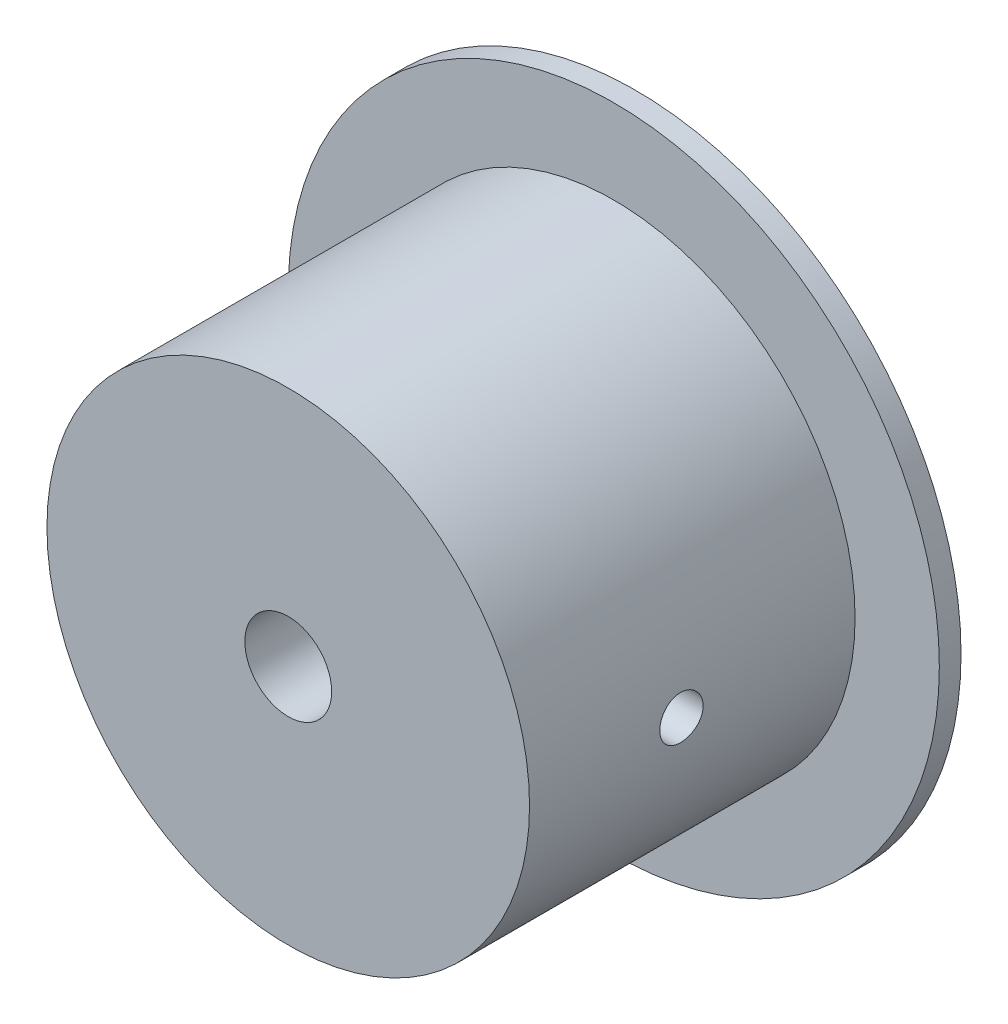
ISO-10303-21;
HEADER;
FILE_DESCRIPTION(('STEP AP214'),'2;1');
FILE_NAME('part.step','',(''),(''),'','','');
FILE_SCHEMA(('AUTOMOTIVE_DESIGN { 1 0 10303 214 1 1 1 1 }'));
ENDSEC;
DATA;
#1=APPLICATION_CONTEXT('core data for automotive mechanical design processes');
#2=APPLICATION_PROTOCOL_DEFINITION('international standard','automotive_design',2000,#1);
#3=PRODUCT_CONTEXT('',#1,'mechanical');
#4=PRODUCT('Part','Part','',(#3));
#5=PRODUCT_RELATED_PRODUCT_CATEGORY('part','',(#4));
#6=PRODUCT_DEFINITION_FORMATION('','',#4);
#7=PRODUCT_DEFINITION_CONTEXT('part definition',#1,'design');
#8=PRODUCT_DEFINITION('design','',#6,#7);
#9=PRODUCT_DEFINITION_SHAPE('','',#8);
#10=(LENGTH_UNIT() NAMED_UNIT(*) SI_UNIT(.MILLI.,.METRE.));
#11=(NAMED_UNIT(*) PLANE_ANGLE_UNIT() SI_UNIT($,.RADIAN.));
#12=(NAMED_UNIT(*) SI_UNIT($,.STERADIAN.) SOLID_ANGLE_UNIT());
#13=UNCERTAINTY_MEASURE_WITH_UNIT(LENGTH_MEASURE(1.E-05),#10,'distance_accuracy_value','');
#14=(GEOMETRIC_REPRESENTATION_CONTEXT(3) GLOBAL_UNCERTAINTY_ASSIGNED_CONTEXT((#13)) GLOBAL_UNIT_ASSIGNED_CONTEXT((#10,
#11,#12)) REPRESENTATION_CONTEXT('',''));
#15=CARTESIAN_POINT('',(0.,0.,0.));
#16=DIRECTION('',(0.,0.,1.));
#17=DIRECTION('',(1.,0.,0.));
#18=AXIS2_PLACEMENT_3D('',#15,#16,#17);
#19=CARTESIAN_POINT('',(-15.799728609314,0.,1.));
#20=DIRECTION('',(0.,0.,1.));
#21=DIRECTION('',(1.,0.,0.));
#22=AXIS2_PLACEMENT_3D('',#19,#20,#21);
#23=PLANE('',#22);
#24=CARTESIAN_POINT('',(-15.799728609314,0.,1.));
#25=DIRECTION('',(0.,0.,1.));
#26=DIRECTION('',(1.,0.,0.));
#27=AXIS2_PLACEMENT_3D('',#24,#25,#26);
#28=CIRCLE('',#27,15.);
#29=CARTESIAN_POINT('',(-0.799728609313974,0.,1.));
#30=VERTEX_POINT('',#29);
#31=EDGE_CURVE('E10',#30,#30,#28,.T.);
#32=ORIENTED_EDGE('',*,*,#31,.T.);
#33=EDGE_LOOP('',(#32));
#34=FACE_BOUND('',#33,.T.);
#35=CARTESIAN_POINT('',(-15.799728609314,0.,1.));
#36=DIRECTION('',(0.,0.,1.));
#37=DIRECTION('',(1.,0.,0.));
#38=AXIS2_PLACEMENT_3D('',#35,#36,#37);
#39=CIRCLE('',#38,11.1180134592339);
#40=CARTESIAN_POINT('',(-4.68171515008008,0.,1.));
#41=VERTEX_POINT('',#40);
#42=EDGE_CURVE('E53',#41,#41,#39,.T.);
#43=ORIENTED_EDGE('',*,*,#42,.F.);
#44=EDGE_LOOP('',(#43));
#45=FACE_BOUND('',#44,.T.);
#46=ADVANCED_FACE('F32',(#34,#45),#23,.T.);
#47=CARTESIAN_POINT('',(-15.799728609314,0.,1.));
#48=DIRECTION('',(0.,0.,-1.));
#49=DIRECTION('',(-1.,0.,0.));
#50=AXIS2_PLACEMENT_3D('',#47,#48,#49);
#51=CYLINDRICAL_SURFACE('',#50,15.);
#52=ORIENTED_EDGE('',*,*,#31,.F.);
#53=EDGE_LOOP('',(#52));
#54=FACE_BOUND('',#53,.T.);
#55=CARTESIAN_POINT('',(-15.799728609314,0.,0.));
#56=DIRECTION('',(0.,0.,1.));
#57=DIRECTION('',(1.,0.,0.));
#58=AXIS2_PLACEMENT_3D('',#55,#56,#57);
#59=CIRCLE('',#58,15.);
#60=CARTESIAN_POINT('',(-0.799728609313974,0.,0.));
#61=VERTEX_POINT('',#60);
#62=EDGE_CURVE('E45',#61,#61,#59,.T.);
#63=ORIENTED_EDGE('',*,*,#62,.T.);
#64=EDGE_LOOP('',(#63));
#65=FACE_BOUND('',#64,.T.);
#66=ADVANCED_FACE('F34',(#54,#65),#51,.T.);
#67=CARTESIAN_POINT('',(-15.799728609314,0.,0.));
#68=DIRECTION('',(0.,0.,1.));
#69=DIRECTION('',(1.,0.,0.));
#70=AXIS2_PLACEMENT_3D('',#67,#68,#69);
#71=PLANE('',#70);
#72=CARTESIAN_POINT('',(-15.799728609314,0.,0.));
#73=DIRECTION('',(0.,0.,1.));
#74=DIRECTION('',(1.,0.,0.));
#75=AXIS2_PLACEMENT_3D('',#72,#73,#74);
#76=CIRCLE('',#75,2.);
#77=CARTESIAN_POINT('',(-13.799728609314,0.,0.));
#78=VERTEX_POINT('',#77);
#79=EDGE_CURVE('E102',#78,#78,#76,.T.);
#80=ORIENTED_EDGE('',*,*,#79,.T.);
#81=EDGE_LOOP('',(#80));
#82=FACE_BOUND('',#81,.T.);
#83=ORIENTED_EDGE('',*,*,#62,.F.);
#84=EDGE_LOOP('',(#83));
#85=FACE_BOUND('',#84,.T.);
#86=ADVANCED_FACE('F89',(#82,#85),#71,.F.);
#87=CARTESIAN_POINT('',(-15.799728609314,0.,16.));
#88=DIRECTION('',(0.,0.,-1.));
#89=DIRECTION('',(-1.,0.,0.));
#90=AXIS2_PLACEMENT_3D('',#87,#88,#89);
#91=CYLINDRICAL_SURFACE('',#90,11.1180134592339);
#92=CARTESIAN_POINT('',(-26.9177420685479,0.,10.));
#93=CARTESIAN_POINT('',(-26.9177414827585,-0.0560489312070736,9.99999755944538));
#94=CARTESIAN_POINT('',(-26.9173137188662,-0.112135606415451,9.99527191987606));
#95=CARTESIAN_POINT('',(-26.915648413895,-0.222755975693165,9.97649065192564));
#96=CARTESIAN_POINT('',(-26.9144099648907,-0.277287856931271,9.9624245624686));
#97=CARTESIAN_POINT('',(-26.9112631834632,-0.38318058620067,9.92537347708459));
#98=CARTESIAN_POINT('',(-26.9093552397394,-0.434543253931594,9.90239365553417));
#99=CARTESIAN_POINT('',(-26.9050832001636,-0.532670505193877,9.8481769782999));
#100=CARTESIAN_POINT('',(-26.9027191993308,-0.579436043476441,9.81694184210624));
#101=CARTESIAN_POINT('',(-26.8977923647739,-0.667191045433643,9.74700218555355));
#102=CARTESIAN_POINT('',(-26.8952290277216,-0.708165099548381,9.70827836414843));
#103=CARTESIAN_POINT('',(-26.8901966246449,-0.783041720369811,9.62450152024458));
#104=CARTESIAN_POINT('',(-26.8877275628464,-0.816943970395644,9.57944821445776));
#105=CARTESIAN_POINT('',(-26.8831579719634,-0.876767797763691,9.48419667699912));
#106=CARTESIAN_POINT('',(-26.8810580786219,-0.902675664841777,9.43398980132537));
#107=CARTESIAN_POINT('',(-26.8774705525038,-0.945687735150198,9.32991643740842));
#108=CARTESIAN_POINT('',(-26.8759829073027,-0.96279211703224,9.27605002345442));
#109=CARTESIAN_POINT('',(-26.873792683784,-0.987666575092418,9.16634223901157));
#110=CARTESIAN_POINT('',(-26.8730879779845,-0.995461950979506,9.11050664799713));
#111=CARTESIAN_POINT('',(-26.8725367505554,-1.00157529144871,8.9983154653808));
#112=CARTESIAN_POINT('',(-26.872690210405,-0.999893460567036,8.94195988502746));
#113=CARTESIAN_POINT('',(-26.8738360377045,-0.987121015635468,8.8305022112316));
#114=CARTESIAN_POINT('',(-26.874825949293,-0.97605794500835,8.77539693267881));
#115=CARTESIAN_POINT('',(-26.8775292966495,-0.944879876692087,8.66782853022101));
#116=CARTESIAN_POINT('',(-26.8792427405036,-0.924764777839823,8.61536543585165));
#117=CARTESIAN_POINT('',(-26.8832029181427,-0.876022971724231,8.514483147561));
#118=CARTESIAN_POINT('',(-26.885450421994,-0.847383958547712,8.46606993076248));
#119=CARTESIAN_POINT('',(-26.890224796091,-0.782416140243146,8.37472705078528));
#120=CARTESIAN_POINT('',(-26.8927516729398,-0.746087153345197,8.33179751726432));
#121=CARTESIAN_POINT('',(-26.8978110116449,-0.666616393301843,8.25248050139696));
#122=CARTESIAN_POINT('',(-26.9003434613415,-0.623450817676038,8.21611686262524));
#123=CARTESIAN_POINT('',(-26.9051200591236,-0.531615086518611,8.15114838948485));
#124=CARTESIAN_POINT('',(-26.9073642069721,-0.482944926460261,8.12254356149675));
#125=CARTESIAN_POINT('',(-26.9113118855579,-0.381465711905152,8.07390598223449));
#126=CARTESIAN_POINT('',(-26.9130153460514,-0.328656120741597,8.05387434463489));
#127=CARTESIAN_POINT('',(-26.9156889487851,-0.220404480827605,8.02296875697824));
#128=CARTESIAN_POINT('',(-26.9166591087579,-0.16496249576781,8.01209458547589));
#129=CARTESIAN_POINT('',(-26.9177545240144,-0.0532264644695321,7.99984263491597));
#130=CARTESIAN_POINT('',(-26.9178827083903,0.00306394432534224,7.9984319336647));
#131=CARTESIAN_POINT('',(-26.9172875643528,0.115080432984275,8.00506063932399));
#132=CARTESIAN_POINT('',(-26.9165642452139,0.170806518988101,8.0130999433079));
#133=CARTESIAN_POINT('',(-26.9143492953546,0.280018199265701,8.03837315626125));
#134=CARTESIAN_POINT('',(-26.9128589447755,0.333507366532665,8.05559174712052));
#135=CARTESIAN_POINT('',(-26.90927726725,0.43683767044956,8.0987190796972));
#136=CARTESIAN_POINT('',(-26.9071859292955,0.486678740258358,8.12462798059158));
#137=CARTESIAN_POINT('',(-26.9026292216197,0.581447503820078,8.18448280066095));
#138=CARTESIAN_POINT('',(-26.9001628466098,0.626361415907962,8.21845046275627));
#139=CARTESIAN_POINT('',(-26.8951363477494,0.70986166022029,8.2934272671237));
#140=CARTESIAN_POINT('',(-26.8925762220011,0.748447864263663,8.33443655200429));
#141=CARTESIAN_POINT('',(-26.8876420380404,0.81831081979215,8.42247565876521));
#142=CARTESIAN_POINT('',(-26.8852685411766,0.849566041025018,8.46952260170884));
#143=CARTESIAN_POINT('',(-26.8809845432443,0.903732041628568,8.56821660548823));
#144=CARTESIAN_POINT('',(-26.8790740369044,0.926642916007259,8.61986361393971));
#145=CARTESIAN_POINT('',(-26.8759356353572,0.963433428166379,8.72621634505253));
#146=CARTESIAN_POINT('',(-26.8747067548404,0.977326106982661,8.78091752616897));
#147=CARTESIAN_POINT('',(-26.8730675453006,0.995728271699165,8.89188770191091));
#148=CARTESIAN_POINT('',(-26.8726571976645,1.00023797096483,8.94815666085623));
#149=CARTESIAN_POINT('',(-26.8727018354105,0.99974351519257,9.06045115147152));
#150=CARTESIAN_POINT('',(-26.8731537442208,0.994773185370975,9.11647683639583));
#151=CARTESIAN_POINT('',(-26.8748654311002,0.975530439463385,9.22689413786496));
#152=CARTESIAN_POINT('',(-26.8761252102906,0.961258010465467,9.28128575214145));
#153=CARTESIAN_POINT('',(-26.8793098672973,0.923825073253928,9.38689219382644));
#154=CARTESIAN_POINT('',(-26.8812346883857,0.900665323104285,9.43810729175032));
#155=CARTESIAN_POINT('',(-26.8855326579753,0.846118814895534,9.53592821850127));
#156=CARTESIAN_POINT('',(-26.8879058011453,0.814732154662348,9.58253410212727));
#157=CARTESIAN_POINT('',(-26.8928431272165,0.744495602010055,9.66998689176947));
#158=CARTESIAN_POINT('',(-26.8954079349804,0.705620582970568,9.71081358255261));
#159=CARTESIAN_POINT('',(-26.9004338804185,0.621558360986442,9.78538027209366));
#160=CARTESIAN_POINT('',(-26.9028949929569,0.576369638912179,9.8191185604168));
#161=CARTESIAN_POINT('',(-26.90744142254,0.480861851436244,9.87860391248552));
#162=CARTESIAN_POINT('',(-26.9095259379378,0.430532190831401,9.90433401169016));
#163=CARTESIAN_POINT('',(-26.913075205912,0.326281672712486,9.94694467825576));
#164=CARTESIAN_POINT('',(-26.9145406654286,0.272364993371367,9.96383534523599));
#165=CARTESIAN_POINT('',(-26.9163134827464,0.181779139731422,9.98401961408163));
#166=CARTESIAN_POINT('',(-26.9168467414466,0.145691275030056,9.99000421062467));
#167=CARTESIAN_POINT('',(-26.9175612247611,0.0730742880279073,9.9979951929014));
#168=CARTESIAN_POINT('',(-26.9177424504958,0.0365451671318992,10.0000015912967));
#169=CARTESIAN_POINT('',(-26.9177420685479,0.,10.));
#170=B_SPLINE_CURVE_WITH_KNOTS('',3,(#92,#93,#94,#95,#96,#97,#98,#99,#100,#101,#102,#103,#104,
#105,#106,#107,#108,#109,#110,#111,#112,#113,#114,#115,#116,#117,#118,#119,#120,#121,#122,#123,
#124,#125,#126,#127,#128,#129,#130,#131,#132,#133,#134,#135,#136,#137,#138,#139,#140,#141,#142,
#143,#144,#145,#146,#147,#148,#149,#150,#151,#152,#153,#154,#155,#156,#157,#158,#159,#160,#161,
#162,#163,#164,#165,#166,#167,#168,#169),.UNSPECIFIED.,.T.,.F.,(4,2,2,2,2,2,2,2,2,2,2,2,2,2,2,2,
2,2,2,2,2,2,2,2,2,2,2,2,2,2,2,2,2,2,2,2,2,2,4),(0.,0.168013356595523,0.336215202137602,
0.50431955312653,0.672388917406351,0.840897373589076,1.00941337409166,1.17821679142045,
1.34701678303688,1.51535696388275,1.68369351164001,1.85153752588468,2.01938341595707,
2.18747280911062,2.35556617588047,2.52425819561685,2.69295035407914,2.86166441934338,
3.03037440465716,3.19849716391765,3.36661809205223,3.53445933938831,3.70230366117413,
3.87060609075172,4.0389119292289,4.20770604073982,4.37649823031556,4.54504578582621,
4.71358950858662,4.88153298373763,5.04947669200571,5.21740607832179,5.38533346788555,
5.55383446201242,5.72237606892721,5.8912723216007,6.05997517580476,6.16952402191638,
6.27907251936213),.UNSPECIFIED.);
#171=CARTESIAN_POINT('',(-26.9177420685479,0.,10.));
#172=VERTEX_POINT('',#171);
#173=EDGE_CURVE('E79',#172,#172,#170,.T.);
#174=ORIENTED_EDGE('',*,*,#173,.T.);
#175=EDGE_LOOP('',(#174));
#176=FACE_BOUND('',#175,.T.);
#177=CARTESIAN_POINT('',(-4.68171515008008,0.,8.));
#178=CARTESIAN_POINT('',(-4.68171573586945,-0.0560489312070736,8.00000244055463));
#179=CARTESIAN_POINT('',(-4.6821434997618,-0.112135606415451,8.00472808012394));
#180=CARTESIAN_POINT('',(-4.68380880473298,-0.222755975693166,8.02350934807437));
#181=CARTESIAN_POINT('',(-4.68504725373722,-0.277287856931271,8.03757543753141));
#182=CARTESIAN_POINT('',(-4.68819403516474,-0.38318058620067,8.07462652291541));
#183=CARTESIAN_POINT('',(-4.69010197888855,-0.434543253931593,8.09760634446583));
#184=CARTESIAN_POINT('',(-4.69437401846438,-0.532670505193876,8.1518230217001));
#185=CARTESIAN_POINT('',(-4.69673801929712,-0.57943604347644,8.18305815789376));
#186=CARTESIAN_POINT('',(-4.70166485385407,-0.667191045433643,8.25299781444645));
#187=CARTESIAN_POINT('',(-4.70422819090639,-0.708165099548381,8.29172163585157));
#188=CARTESIAN_POINT('',(-4.70926059398302,-0.783041720369811,8.37549847975542));
#189=CARTESIAN_POINT('',(-4.71172965578156,-0.816943970395644,8.42055178554225));
#190=CARTESIAN_POINT('',(-4.71629924666457,-0.876767797763691,8.51580332300088));
#191=CARTESIAN_POINT('',(-4.71839914000606,-0.902675664841777,8.56601019867463));
#192=CARTESIAN_POINT('',(-4.72198666612417,-0.945687735150198,8.67008356259158));
#193=CARTESIAN_POINT('',(-4.72347431132519,-0.96279211703224,8.72394997654558));
#194=CARTESIAN_POINT('',(-4.72566453484399,-0.987666575092418,8.83365776098843));
#195=CARTESIAN_POINT('',(-4.72636924064349,-0.995461950979506,8.88949335200287));
#196=CARTESIAN_POINT('',(-4.72692046807256,-1.00157529144871,9.00168453461921));
#197=CARTESIAN_POINT('',(-4.72676700822298,-0.999893460567036,9.05804011497254));
#198=CARTESIAN_POINT('',(-4.72562118092341,-0.987121015635468,9.16949778876841));
#199=CARTESIAN_POINT('',(-4.72463126933498,-0.97605794500835,9.22460306732119));
#200=CARTESIAN_POINT('',(-4.72192792197845,-0.944879876692087,9.33217146977899));
#201=CARTESIAN_POINT('',(-4.72021447812435,-0.924764777839823,9.38463456414835));
#202=CARTESIAN_POINT('',(-4.71625430048521,-0.876022971724231,9.485516852439));
#203=CARTESIAN_POINT('',(-4.71400679663397,-0.847383958547712,9.53393006923753));
#204=CARTESIAN_POINT('',(-4.70923242253693,-0.782416140243146,9.62527294921472));
#205=CARTESIAN_POINT('',(-4.70670554568819,-0.746087153345197,9.66820248273569));
#206=CARTESIAN_POINT('',(-4.70164620698308,-0.666616393301843,9.74751949860304));
#207=CARTESIAN_POINT('',(-4.69911375728645,-0.623450817676038,9.78388313737476));
#208=CARTESIAN_POINT('',(-4.6943371595043,-0.531615086518611,9.84885161051515));
#209=CARTESIAN_POINT('',(-4.69209301165586,-0.482944926460261,9.87745643850326));
#210=CARTESIAN_POINT('',(-4.68814533307009,-0.381465711905152,9.92609401776551));
#211=CARTESIAN_POINT('',(-4.68644187257656,-0.328656120741597,9.94612565536511));
#212=CARTESIAN_POINT('',(-4.6837682698428,-0.220404480827605,9.97703124302176));
#213=CARTESIAN_POINT('',(-4.68279810987,-0.16496249576781,9.98790541452412));
#214=CARTESIAN_POINT('',(-4.68170269461351,-0.0532264644695322,10.000157365084));
#215=CARTESIAN_POINT('',(-4.68157451023769,0.00306394432534213,10.0015680663353));
#216=CARTESIAN_POINT('',(-4.68216965427514,0.115080432984275,9.99493936067601));
#217=CARTESIAN_POINT('',(-4.68289297341409,0.170806518988101,9.9869000566921));
#218=CARTESIAN_POINT('',(-4.68510792327334,0.280018199265701,9.96162684373876));
#219=CARTESIAN_POINT('',(-4.6865982738524,0.333507366532665,9.94440825287949));
#220=CARTESIAN_POINT('',(-4.69017995137797,0.43683767044956,9.90128092030281));
#221=CARTESIAN_POINT('',(-4.69227128933242,0.486678740258358,9.87537201940842));
#222=CARTESIAN_POINT('',(-4.69682799700823,0.581447503820078,9.81551719933905));
#223=CARTESIAN_POINT('',(-4.69929437201817,0.626361415907963,9.78154953724373));
#224=CARTESIAN_POINT('',(-4.70432087087855,0.709861660220291,9.7065727328763));
#225=CARTESIAN_POINT('',(-4.70688099662681,0.748447864263664,9.66556344799571));
#226=CARTESIAN_POINT('',(-4.71181518058754,0.818310819792151,9.57752434123479));
#227=CARTESIAN_POINT('',(-4.71418867745133,0.849566041025019,9.53047739829116));
#228=CARTESIAN_POINT('',(-4.7184726753836,0.903732041628569,9.43178339451177));
#229=CARTESIAN_POINT('',(-4.72038318172358,0.926642916007259,9.3801363860603));
#230=CARTESIAN_POINT('',(-4.72352158327079,0.963433428166378,9.27378365494748));
#231=CARTESIAN_POINT('',(-4.72475046378759,0.977326106982661,9.21908247383103));
#232=CARTESIAN_POINT('',(-4.72638967332734,0.995728271699165,9.10811229808909));
#233=CARTESIAN_POINT('',(-4.72680002096341,1.00023797096483,9.05184333914377));
#234=CARTESIAN_POINT('',(-4.7267553832174,0.99974351519257,8.93954884852849));
#235=CARTESIAN_POINT('',(-4.72630347440716,0.994773185370975,8.88352316360417));
#236=CARTESIAN_POINT('',(-4.7245917875278,0.975530439463386,8.77310586213505));
#237=CARTESIAN_POINT('',(-4.7233320083373,0.961258010465467,8.71871424785855));
#238=CARTESIAN_POINT('',(-4.72014735133069,0.923825073253928,8.61310780617356));
#239=CARTESIAN_POINT('',(-4.71822253024222,0.900665323104285,8.56189270824968));
#240=CARTESIAN_POINT('',(-4.71392456065268,0.846118814895535,8.46407178149874));
#241=CARTESIAN_POINT('',(-4.71155141748269,0.814732154662349,8.41746589787273));
#242=CARTESIAN_POINT('',(-4.70661409141142,0.744495602010055,8.33001310823054));
#243=CARTESIAN_POINT('',(-4.7040492836476,0.705620582970568,8.2891864174474));
#244=CARTESIAN_POINT('',(-4.69902333820945,0.621558360986442,8.21461972790634));
#245=CARTESIAN_POINT('',(-4.69656222567109,0.576369638912179,8.1808814395832));
#246=CARTESIAN_POINT('',(-4.69201579608793,0.480861851436244,8.12139608751448));
#247=CARTESIAN_POINT('',(-4.68993128069014,0.430532190831401,8.09566598830984));
#248=CARTESIAN_POINT('',(-4.68638201271597,0.326281672712486,8.05305532174424));
#249=CARTESIAN_POINT('',(-4.68491655319936,0.272364993371367,8.03616465476402));
#250=CARTESIAN_POINT('',(-4.68314373588152,0.181779139731422,8.01598038591837));
#251=CARTESIAN_POINT('',(-4.68261047718133,0.145691275030056,8.00999578937533));
#252=CARTESIAN_POINT('',(-4.68189599386688,0.0730742880279073,8.0020048070986));
#253=CARTESIAN_POINT('',(-4.68171476813219,0.0365451671318992,7.99999840870334));
#254=CARTESIAN_POINT('',(-4.68171515008008,0.,8.));
#255=B_SPLINE_CURVE_WITH_KNOTS('',3,(#177,#178,#179,#180,#181,#182,#183,#184,#185,#186,#187,
#188,#189,#190,#191,#192,#193,#194,#195,#196,#197,#198,#199,#200,#201,#202,#203,#204,#205,#206,
#207,#208,#209,#210,#211,#212,#213,#214,#215,#216,#217,#218,#219,#220,#221,#222,#223,#224,#225,
#226,#227,#228,#229,#230,#231,#232,#233,#234,#235,#236,#237,#238,#239,#240,#241,#242,#243,#244,
#245,#246,#247,#248,#249,#250,#251,#252,#253,#254),.UNSPECIFIED.,.T.,.F.,(4,2,2,2,2,2,2,2,2,2,2,
2,2,2,2,2,2,2,2,2,2,2,2,2,2,2,2,2,2,2,2,2,2,2,2,2,2,2,4),(0.,0.168013356595523,
0.336215202137602,0.504319553126529,0.672388917406351,0.840897373589076,1.00941337409166,
1.17821679142045,1.34701678303688,1.51535696388275,1.68369351164001,1.85153752588468,
2.01938341595707,2.18747280911062,2.35556617588047,2.52425819561685,2.69295035407914,
2.86166441934338,3.03037440465716,3.19849716391765,3.36661809205223,3.53445933938831,
3.70230366117413,3.87060609075173,4.0389119292289,4.20770604073982,4.37649823031556,
4.54504578582621,4.71358950858661,4.88153298373763,5.04947669200571,5.21740607832179,
5.38533346788555,5.55383446201242,5.72237606892721,5.8912723216007,6.05997517580476,
6.16952402191638,6.27907251936212),.UNSPECIFIED.);
#256=CARTESIAN_POINT('',(-4.68171515008008,0.,8.));
#257=VERTEX_POINT('',#256);
#258=EDGE_CURVE('E73',#257,#257,#255,.T.);
#259=ORIENTED_EDGE('',*,*,#258,.T.);
#260=EDGE_LOOP('',(#259));
#261=FACE_BOUND('',#260,.T.);
#262=CARTESIAN_POINT('',(-15.799728609314,0.,16.));
#263=DIRECTION('',(0.,0.,1.));
#264=DIRECTION('',(1.,0.,0.));
#265=AXIS2_PLACEMENT_3D('',#262,#263,#264);
#266=CIRCLE('',#265,11.1180134592339);
#267=CARTESIAN_POINT('',(-4.68171515008008,0.,16.));
#268=VERTEX_POINT('',#267);
#269=EDGE_CURVE('E50',#268,#268,#266,.T.);
#270=ORIENTED_EDGE('',*,*,#269,.F.);
#271=EDGE_LOOP('',(#270));
#272=FACE_BOUND('',#271,.T.);
#273=ORIENTED_EDGE('',*,*,#42,.T.);
#274=EDGE_LOOP('',(#273));
#275=FACE_BOUND('',#274,.T.);
#276=ADVANCED_FACE('F84',(#176,#261,#272,#275),#91,.T.);
#277=CARTESIAN_POINT('',(-15.799728609314,0.,16.));
#278=DIRECTION('',(0.,0.,1.));
#279=DIRECTION('',(1.,0.,0.));
#280=AXIS2_PLACEMENT_3D('',#277,#278,#279);
#281=PLANE('',#280);
#282=CARTESIAN_POINT('',(-15.799728609314,0.,16.));
#283=DIRECTION('',(0.,0.,1.));
#284=DIRECTION('',(1.,0.,0.));
#285=AXIS2_PLACEMENT_3D('',#282,#283,#284);
#286=CIRCLE('',#285,2.);
#287=CARTESIAN_POINT('',(-13.799728609314,0.,16.));
#288=VERTEX_POINT('',#287);
#289=EDGE_CURVE('E106',#288,#288,#286,.T.);
#290=ORIENTED_EDGE('',*,*,#289,.F.);
#291=EDGE_LOOP('',(#290));
#292=FACE_BOUND('',#291,.T.);
#293=ORIENTED_EDGE('',*,*,#269,.T.);
#294=EDGE_LOOP('',(#293));
#295=FACE_BOUND('',#294,.T.);
#296=ADVANCED_FACE('F88',(#292,#295),#281,.T.);
#297=CARTESIAN_POINT('',(-15.799728609314,0.,0.));
#298=DIRECTION('',(0.,0.,1.));
#299=DIRECTION('',(1.,0.,0.));
#300=AXIS2_PLACEMENT_3D('',#297,#298,#299);
#301=CYLINDRICAL_SURFACE('',#300,2.);
#302=CARTESIAN_POINT('',(-13.799728609314,0.,8.));
#303=CARTESIAN_POINT('',(-13.7997314752725,0.0525719629529866,8.0000033023195));
#304=CARTESIAN_POINT('',(-13.8018236991188,0.105206599698033,8.00417007312167));
#305=CARTESIAN_POINT('',(-13.80998704894,0.208920235268425,8.02065288034092));
#306=CARTESIAN_POINT('',(-13.8160657310241,0.259996086713504,8.03298439299765));
#307=CARTESIAN_POINT('',(-13.8315658152809,0.358933544880575,8.06519380861679));
#308=CARTESIAN_POINT('',(-13.8409742175388,0.406806802939181,8.08504238424801));
#309=CARTESIAN_POINT('',(-13.8622708441562,0.498472616806566,8.13157062136494));
#310=CARTESIAN_POINT('',(-13.8741588729787,0.54226549399005,8.15824974424885));
#311=CARTESIAN_POINT('',(-13.9001660267334,0.62750781776192,8.2195172494853));
#312=CARTESIAN_POINT('',(-13.9143766180386,0.668655211122113,8.25448647923964));
#313=CARTESIAN_POINT('',(-13.9431289068465,0.744779444866979,8.33052147924703));
#314=CARTESIAN_POINT('',(-13.9576708472236,0.779751583106768,8.37159185177244));
#315=CARTESIAN_POINT('',(-13.9867390973405,0.84525200045028,8.46248334952338));
#316=CARTESIAN_POINT('',(-14.0011767396127,0.875225335551638,8.51273609834591));
#317=CARTESIAN_POINT('',(-14.0268688215908,0.926168226890696,8.61836733598621));
#318=CARTESIAN_POINT('',(-14.0381255332441,0.947144214966335,8.67374212872275));
#319=CARTESIAN_POINT('',(-14.0551499389359,0.97813244218859,8.78466510542192));
#320=CARTESIAN_POINT('',(-14.0612058934768,0.988725857080443,8.84000445206739));
#321=CARTESIAN_POINT('',(-14.0679097098287,1.00042699330885,8.95197883777948));
#322=CARTESIAN_POINT('',(-14.0685629158811,1.00154408837308,9.00861254087116));
#323=CARTESIAN_POINT('',(-14.0646193067415,0.994687287172296,9.11428602431537));
#324=CARTESIAN_POINT('',(-14.0606409726938,0.987784559536823,9.16342403122305));
#325=CARTESIAN_POINT('',(-14.0489663219755,0.966939849056933,9.25972190937304));
#326=CARTESIAN_POINT('',(-14.0412688209962,0.952995623897653,9.30688114530532));
#327=CARTESIAN_POINT('',(-14.0228538451866,0.918209780386005,9.39922913256566));
#328=CARTESIAN_POINT('',(-14.012070202674,0.897215067115996,9.44434639878579));
#329=CARTESIAN_POINT('',(-13.9886945664999,0.849041687668004,9.53063429259001));
#330=CARTESIAN_POINT('',(-13.9761017615121,0.821860243812469,9.57180313560009));
#331=CARTESIAN_POINT('',(-13.9485970302811,0.75806605491279,9.65452125274323));
#332=CARTESIAN_POINT('',(-13.9335935069465,0.720694458369283,9.69545687357616));
#333=CARTESIAN_POINT('',(-13.9042523763099,0.639555578741375,9.7707354185909));
#334=CARTESIAN_POINT('',(-13.889915089726,0.595785256574287,9.80507519203389));
#335=CARTESIAN_POINT('',(-13.8627087364843,0.500516505831851,9.86768566102973));
#336=CARTESIAN_POINT('',(-13.8499387676939,0.448753591599411,9.89560047244574));
#337=CARTESIAN_POINT('',(-13.8281497981016,0.340466215488798,9.94209702904301));
#338=CARTESIAN_POINT('',(-13.8191278198784,0.283945576265278,9.96068618501517));
#339=CARTESIAN_POINT('',(-13.8064852718996,0.172766491660703,9.98647540371668));
#340=CARTESIAN_POINT('',(-13.8024792263009,0.118341530548325,9.99449123574678));
#341=CARTESIAN_POINT('',(-13.798998474723,0.00877959994935464,10.0014647311345));
#342=CARTESIAN_POINT('',(-13.7995216221009,-0.0463570198699005,10.0004266856395));
#343=CARTESIAN_POINT('',(-13.8048166867796,-0.151232971985993,9.98979331158125));
#344=CARTESIAN_POINT('',(-13.8092561524321,-0.201059408049953,9.98086746726997));
#345=CARTESIAN_POINT('',(-13.8215068961658,-0.298406892301916,9.95576192810492));
#346=CARTESIAN_POINT('',(-13.8293185459706,-0.345927685690996,9.93958143354664));
#347=CARTESIAN_POINT('',(-13.8478860951773,-0.438888608449665,9.90000153356683));
#348=CARTESIAN_POINT('',(-13.8587197916146,-0.484230397006153,9.87640894988319));
#349=CARTESIAN_POINT('',(-13.8822888661429,-0.57046136169892,9.82289246435396));
#350=CARTESIAN_POINT('',(-13.8950250536561,-0.611348629775281,9.79296586540657));
#351=CARTESIAN_POINT('',(-13.9226463959393,-0.691767689290652,9.72423957466713));
#352=CARTESIAN_POINT('',(-13.9376197608296,-0.730772077824638,9.68485713154644));
#353=CARTESIAN_POINT('',(-13.9671046932752,-0.801856321113239,9.6000748487307));
#354=CARTESIAN_POINT('',(-13.9816159354987,-0.833931385690841,9.55467088118363));
#355=CARTESIAN_POINT('',(-14.0092166870533,-0.891707914497696,9.45635634579969));
#356=CARTESIAN_POINT('',(-14.0222033126793,-0.917025495878638,9.40318873379141));
#357=CARTESIAN_POINT('',(-14.0439878856327,-0.958082826013804,9.29248993230748));
#358=CARTESIAN_POINT('',(-14.0527912269078,-0.973834915887571,9.23496447349882));
#359=CARTESIAN_POINT('',(-14.0641135992273,-0.99386168744968,9.12308977713856));
#360=CARTESIAN_POINT('',(-14.0671547747091,-0.999092996400866,9.06896574657097));
#361=CARTESIAN_POINT('',(-14.0680750628522,-1.00068915438079,8.96055293282927));
#362=CARTESIAN_POINT('',(-14.0659564130384,-0.9970578466244,8.90626423126057));
#363=CARTESIAN_POINT('',(-14.0573499888137,-0.981926125592265,8.80451649846799));
#364=CARTESIAN_POINT('',(-14.05129766449,-0.971208314342802,8.7568995298556));
#365=CARTESIAN_POINT('',(-14.0360184474348,-0.943175358224648,8.6641918805753));
#366=CARTESIAN_POINT('',(-14.0267905336172,-0.925858091159813,8.61910201790804));
#367=CARTESIAN_POINT('',(-14.0054433056687,-0.883815745300685,8.5293751490134));
#368=CARTESIAN_POINT('',(-13.9931713853521,-0.85867113781646,8.4849720981703));
#369=CARTESIAN_POINT('',(-13.9673752929681,-0.802150971636636,8.40072546381941));
#370=CARTESIAN_POINT('',(-13.9538504713688,-0.77077217123865,8.36088426948151));
#371=CARTESIAN_POINT('',(-13.9251053777208,-0.698203326664643,8.28185801764239));
#372=CARTESIAN_POINT('',(-13.9098787761993,-0.656284423010173,8.24334089763808));
#373=CARTESIAN_POINT('',(-13.8809510867631,-0.566154806220281,8.17373701657637));
#374=CARTESIAN_POINT('',(-13.8672508232336,-0.517940723256787,8.14265426057371));
#375=CARTESIAN_POINT('',(-13.8427485134629,-0.415931596819949,8.0887636372378));
#376=CARTESIAN_POINT('',(-13.8319676436849,-0.362099503934616,8.06601583058857));
#377=CARTESIAN_POINT('',(-13.8147151956793,-0.250742101294193,8.03019183208105));
#378=CARTESIAN_POINT('',(-13.8082313755847,-0.193227799623168,8.01708815317042));
#379=CARTESIAN_POINT('',(-13.8027739902173,-0.112601946483385,8.00610258892415));
#380=CARTESIAN_POINT('',(-13.801634955922,-0.0901618794394999,8.00381735913638));
#381=CARTESIAN_POINT('',(-13.8001116395353,-0.0451517318071583,8.00076533448319));
#382=CARTESIAN_POINT('',(-13.7997273782763,-0.0225816476473817,7.9999985815288));
#383=CARTESIAN_POINT('',(-13.799728609314,0.,8.));
#384=B_SPLINE_CURVE_WITH_KNOTS('',3,(#302,#303,#304,#305,#306,#307,#308,#309,#310,#311,#312,
#313,#314,#315,#316,#317,#318,#319,#320,#321,#322,#323,#324,#325,#326,#327,#328,#329,#330,#331,
#332,#333,#334,#335,#336,#337,#338,#339,#340,#341,#342,#343,#344,#345,#346,#347,#348,#349,#350,
#351,#352,#353,#354,#355,#356,#357,#358,#359,#360,#361,#362,#363,#364,#365,#366,#367,#368,#369,
#370,#371,#372,#373,#374,#375,#376,#377,#378,#379,#380,#381,#382,#383),.UNSPECIFIED.,.T.,.F.,(4,
2,2,2,2,2,2,2,2,2,2,2,2,2,2,2,2,2,2,2,2,2,2,2,2,2,2,2,2,2,2,2,2,2,2,2,2,2,2,2,4),(0.,
0.157624257420293,0.315548149709198,0.472862155492299,0.630163760581568,0.796981758718091,
0.963926237654038,1.14381726430753,1.32357947898281,1.4925801214023,1.66141357329021,
1.81005712409321,1.95874803925679,2.11090240168488,2.26312521260222,2.43464941333879,
2.60625534598687,2.78583022214441,2.9652621691228,3.12983290471346,3.29432564511476,
3.44606906506122,3.59782921630932,3.75392856027899,3.9100945074834,4.08159610644419,
4.25321588615432,4.43314682159674,4.61284511940778,4.77529307498374,4.93767059860006,
5.08457930244183,5.23153528783679,5.38836456775615,5.54527561138959,5.72125242752499,
5.89732383376574,6.07464013662926,6.25144908624931,6.31915280137699,6.38685838514848),.UNSPECIFIED.);
#385=CARTESIAN_POINT('',(-13.799728609314,0.,8.));
#386=VERTEX_POINT('',#385);
#387=EDGE_CURVE('E36',#386,#386,#384,.T.);
#388=ORIENTED_EDGE('',*,*,#387,.T.);
#389=EDGE_LOOP('',(#388));
#390=FACE_BOUND('',#389,.T.);
#391=CARTESIAN_POINT('',(-17.799728609314,0.,8.));
#392=CARTESIAN_POINT('',(-17.7997257433555,-0.0525719629529865,8.0000033023195));
#393=CARTESIAN_POINT('',(-17.7976335195091,-0.105206599698033,8.00417007312167));
#394=CARTESIAN_POINT('',(-17.7894701696879,-0.208920235268425,8.02065288034092));
#395=CARTESIAN_POINT('',(-17.7833914876038,-0.259996086713504,8.03298439299765));
#396=CARTESIAN_POINT('',(-17.7678914033471,-0.358933544880575,8.06519380861679));
#397=CARTESIAN_POINT('',(-17.7584830010892,-0.40680680293918,8.08504238424801));
#398=CARTESIAN_POINT('',(-17.7371863744718,-0.498472616806565,8.13157062136494));
#399=CARTESIAN_POINT('',(-17.7252983456493,-0.54226549399005,8.15824974424885));
#400=CARTESIAN_POINT('',(-17.6992911918945,-0.62750781776192,8.2195172494853));
#401=CARTESIAN_POINT('',(-17.6850806005893,-0.668655211122113,8.25448647923964));
#402=CARTESIAN_POINT('',(-17.6563283117814,-0.744779444866978,8.33052147924703));
#403=CARTESIAN_POINT('',(-17.6417863714043,-0.779751583106767,8.37159185177244));
#404=CARTESIAN_POINT('',(-17.6127181212874,-0.845252000450279,8.46248334952338));
#405=CARTESIAN_POINT('',(-17.5982804790153,-0.875225335551638,8.51273609834591));
#406=CARTESIAN_POINT('',(-17.5725883970372,-0.926168226890696,8.61836733598621));
#407=CARTESIAN_POINT('',(-17.5613316853839,-0.947144214966335,8.67374212872275));
#408=CARTESIAN_POINT('',(-17.5443072796921,-0.97813244218859,8.78466510542192));
#409=CARTESIAN_POINT('',(-17.5382513251511,-0.988725857080443,8.8400044520674));
#410=CARTESIAN_POINT('',(-17.5315475087992,-1.00042699330885,8.95197883777948));
#411=CARTESIAN_POINT('',(-17.5308943027469,-1.00154408837308,9.00861254087116));
#412=CARTESIAN_POINT('',(-17.5348379118865,-0.994687287172296,9.11428602431537));
#413=CARTESIAN_POINT('',(-17.5388162459341,-0.987784559536823,9.16342403122305));
#414=CARTESIAN_POINT('',(-17.5504908966525,-0.966939849056934,9.25972190937304));
#415=CARTESIAN_POINT('',(-17.5581883976317,-0.952995623897653,9.30688114530532));
#416=CARTESIAN_POINT('',(-17.5766033734414,-0.918209780386005,9.39922913256566));
#417=CARTESIAN_POINT('',(-17.587387015954,-0.897215067115996,9.44434639878579));
#418=CARTESIAN_POINT('',(-17.610762652128,-0.849041687668004,9.53063429259001));
#419=CARTESIAN_POINT('',(-17.6233554571159,-0.821860243812469,9.57180313560009));
#420=CARTESIAN_POINT('',(-17.6508601883468,-0.75806605491279,9.65452125274323));
#421=CARTESIAN_POINT('',(-17.6658637116814,-0.720694458369283,9.69545687357616));
#422=CARTESIAN_POINT('',(-17.695204842318,-0.639555578741375,9.7707354185909));
#423=CARTESIAN_POINT('',(-17.709542128902,-0.595785256574287,9.80507519203389));
#424=CARTESIAN_POINT('',(-17.7367484821436,-0.50051650583185,9.86768566102973));
#425=CARTESIAN_POINT('',(-17.749518450934,-0.44875359159941,9.89560047244574));
#426=CARTESIAN_POINT('',(-17.7713074205264,-0.340466215488798,9.94209702904301));
#427=CARTESIAN_POINT('',(-17.7803293987495,-0.283945576265277,9.96068618501517));
#428=CARTESIAN_POINT('',(-17.7929719467283,-0.172766491660702,9.98647540371668));
#429=CARTESIAN_POINT('',(-17.7969779923271,-0.118341530548325,9.99449123574678));
#430=CARTESIAN_POINT('',(-17.800458743905,-0.00877959994935457,10.0014647311345));
#431=CARTESIAN_POINT('',(-17.7999355965271,0.0463570198699005,10.0004266856395));
#432=CARTESIAN_POINT('',(-17.7946405318484,0.151232971985993,9.98979331158125));
#433=CARTESIAN_POINT('',(-17.7902010661959,0.201059408049954,9.98086746726997));
#434=CARTESIAN_POINT('',(-17.7779503224622,0.298406892301917,9.95576192810492));
#435=CARTESIAN_POINT('',(-17.7701386726573,0.345927685690997,9.93958143354664));
#436=CARTESIAN_POINT('',(-17.7515711234507,0.438888608449665,9.90000153356683));
#437=CARTESIAN_POINT('',(-17.7407374270134,0.484230397006154,9.87640894988319));
#438=CARTESIAN_POINT('',(-17.7171683524851,0.570461361698921,9.82289246435396));
#439=CARTESIAN_POINT('',(-17.7044321649718,0.611348629775282,9.79296586540657));
#440=CARTESIAN_POINT('',(-17.6768108226886,0.691767689290653,9.72423957466713));
#441=CARTESIAN_POINT('',(-17.6618374577984,0.730772077824639,9.68485713154644));
#442=CARTESIAN_POINT('',(-17.6323525253527,0.801856321113239,9.6000748487307));
#443=CARTESIAN_POINT('',(-17.6178412831292,0.833931385690841,9.55467088118363));
#444=CARTESIAN_POINT('',(-17.5902405315747,0.891707914497696,9.45635634579969));
#445=CARTESIAN_POINT('',(-17.5772539059487,0.917025495878638,9.40318873379141));
#446=CARTESIAN_POINT('',(-17.5554693329952,0.958082826013804,9.29248993230748));
#447=CARTESIAN_POINT('',(-17.5466659917202,0.973834915887571,9.23496447349882));
#448=CARTESIAN_POINT('',(-17.5353436194006,0.99386168744968,9.12308977713856));
#449=CARTESIAN_POINT('',(-17.5323024439189,0.999092996400866,9.06896574657097));
#450=CARTESIAN_POINT('',(-17.5313821557757,1.00068915438079,8.96055293282927));
#451=CARTESIAN_POINT('',(-17.5335008055895,0.9970578466244,8.90626423126057));
#452=CARTESIAN_POINT('',(-17.5421072298142,0.981926125592264,8.80451649846799));
#453=CARTESIAN_POINT('',(-17.5481595541379,0.971208314342801,8.7568995298556));
#454=CARTESIAN_POINT('',(-17.5634387711931,0.943175358224646,8.6641918805753));
#455=CARTESIAN_POINT('',(-17.5726666850107,0.925858091159812,8.61910201790803));
#456=CARTESIAN_POINT('',(-17.5940139129593,0.883815745300685,8.5293751490134));
#457=CARTESIAN_POINT('',(-17.6062858332759,0.858671137816459,8.4849720981703));
#458=CARTESIAN_POINT('',(-17.6320819256599,0.802150971636636,8.40072546381941));
#459=CARTESIAN_POINT('',(-17.6456067472592,0.77077217123865,8.36088426948151));
#460=CARTESIAN_POINT('',(-17.6743518409071,0.698203326664643,8.28185801764239));
#461=CARTESIAN_POINT('',(-17.6895784424287,0.656284423010173,8.24334089763808));
#462=CARTESIAN_POINT('',(-17.7185061318648,0.566154806220281,8.17373701657637));
#463=CARTESIAN_POINT('',(-17.7322063953944,0.517940723256786,8.14265426057371));
#464=CARTESIAN_POINT('',(-17.756708705165,0.415931596819948,8.0887636372378));
#465=CARTESIAN_POINT('',(-17.7674895749431,0.362099503934616,8.06601583058857));
#466=CARTESIAN_POINT('',(-17.7847420229486,0.250742101294193,8.03019183208105));
#467=CARTESIAN_POINT('',(-17.7912258430433,0.193227799623168,8.01708815317042));
#468=CARTESIAN_POINT('',(-17.7966832284106,0.112601946483386,8.00610258892415));
#469=CARTESIAN_POINT('',(-17.797822262706,0.0901618794395002,8.00381735913638));
#470=CARTESIAN_POINT('',(-17.7993455790926,0.0451517318071584,8.00076533448319));
#471=CARTESIAN_POINT('',(-17.7997298403516,0.0225816476473818,7.9999985815288));
#472=CARTESIAN_POINT('',(-17.799728609314,0.,8.));
#473=B_SPLINE_CURVE_WITH_KNOTS('',3,(#391,#392,#393,#394,#395,#396,#397,#398,#399,#400,#401,
#402,#403,#404,#405,#406,#407,#408,#409,#410,#411,#412,#413,#414,#415,#416,#417,#418,#419,#420,
#421,#422,#423,#424,#425,#426,#427,#428,#429,#430,#431,#432,#433,#434,#435,#436,#437,#438,#439,
#440,#441,#442,#443,#444,#445,#446,#447,#448,#449,#450,#451,#452,#453,#454,#455,#456,#457,#458,
#459,#460,#461,#462,#463,#464,#465,#466,#467,#468,#469,#470,#471,#472),.UNSPECIFIED.,.T.,.F.,(4,
2,2,2,2,2,2,2,2,2,2,2,2,2,2,2,2,2,2,2,2,2,2,2,2,2,2,2,2,2,2,2,2,2,2,2,2,2,2,2,4),(0.,
0.157624257420293,0.315548149709198,0.472862155492298,0.630163760581568,0.796981758718089,
0.963926237654036,1.14381726430753,1.32357947898281,1.4925801214023,1.66141357329021,
1.81005712409321,1.95874803925679,2.11090240168488,2.26312521260222,2.43464941333879,
2.60625534598687,2.78583022214441,2.9652621691228,3.12983290471346,3.29432564511476,
3.44606906506122,3.59782921630932,3.75392856027899,3.9100945074834,4.08159610644419,
4.25321588615432,4.43314682159674,4.61284511940778,4.77529307498374,4.93767059860006,
5.08457930244183,5.23153528783679,5.38836456775615,5.54527561138958,5.72125242752499,
5.89732383376573,6.07464013662926,6.25144908624931,6.31915280137698,6.38685838514848),.UNSPECIFIED.);
#474=CARTESIAN_POINT('',(-17.799728609314,0.,8.));
#475=VERTEX_POINT('',#474);
#476=EDGE_CURVE('E55',#475,#475,#473,.T.);
#477=ORIENTED_EDGE('',*,*,#476,.T.);
#478=EDGE_LOOP('',(#477));
#479=FACE_BOUND('',#478,.T.);
#480=ORIENTED_EDGE('',*,*,#79,.F.);
#481=EDGE_LOOP('',(#480));
#482=FACE_BOUND('',#481,.T.);
#483=ORIENTED_EDGE('',*,*,#289,.T.);
#484=EDGE_LOOP('',(#483));
#485=FACE_BOUND('',#484,.T.);
#486=ADVANCED_FACE('F60',(#390,#479,#482,#485),#301,.F.);
#487=CARTESIAN_POINT('',(-30.799728609314,0.,9.));
#488=DIRECTION('',(1.,0.,0.));
#489=DIRECTION('',(0.,0.,-1.));
#490=AXIS2_PLACEMENT_3D('',#487,#488,#489);
#491=CYLINDRICAL_SURFACE('',#490,1.);
#492=ORIENTED_EDGE('',*,*,#476,.F.);
#493=EDGE_LOOP('',(#492));
#494=FACE_BOUND('',#493,.T.);
#495=ORIENTED_EDGE('',*,*,#173,.F.);
#496=EDGE_LOOP('',(#495));
#497=FACE_BOUND('',#496,.T.);
#498=ADVANCED_FACE('F63',(#494,#497),#491,.F.);
#499=ORIENTED_EDGE('',*,*,#387,.F.);
#500=EDGE_LOOP('',(#499));
#501=FACE_BOUND('',#500,.T.);
#502=ORIENTED_EDGE('',*,*,#258,.F.);
#503=EDGE_LOOP('',(#502));
#504=FACE_BOUND('',#503,.T.);
#505=ADVANCED_FACE('F66',(#501,#504),#491,.F.);
#506=CLOSED_SHELL('',(#46,#66,#86,#276,#296,#486,#498,#505));
#507=MANIFOLD_SOLID_BREP('B2',#506);
#508=ADVANCED_BREP_SHAPE_REPRESENTATION('',(#18,#507),#14);
#509=SHAPE_DEFINITION_REPRESENTATION(#9,#508);
ENDSEC;
END-ISO-10303-21;
